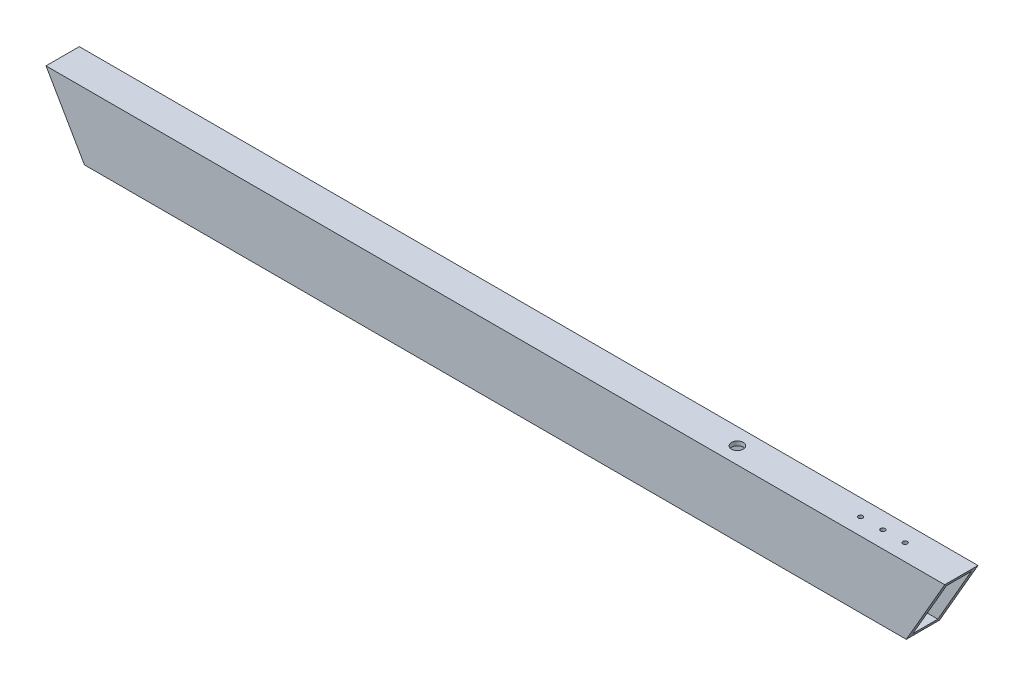
ISO-10303-21;
HEADER;
FILE_DESCRIPTION(('STEP AP214'),'2;1');
FILE_NAME('part.step','',(''),(''),'','','');
FILE_SCHEMA(('AUTOMOTIVE_DESIGN { 1 0 10303 214 1 1 1 1 }'));
ENDSEC;
DATA;
#1=APPLICATION_CONTEXT('core data for automotive mechanical design processes');
#2=APPLICATION_PROTOCOL_DEFINITION('international standard','automotive_design',2000,#1);
#3=PRODUCT_CONTEXT('',#1,'mechanical');
#4=PRODUCT('Part','Part','',(#3));
#5=PRODUCT_RELATED_PRODUCT_CATEGORY('part','',(#4));
#6=PRODUCT_DEFINITION_FORMATION('','',#4);
#7=PRODUCT_DEFINITION_CONTEXT('part definition',#1,'design');
#8=PRODUCT_DEFINITION('design','',#6,#7);
#9=PRODUCT_DEFINITION_SHAPE('','',#8);
#10=(LENGTH_UNIT() NAMED_UNIT(*) SI_UNIT(.MILLI.,.METRE.));
#11=(NAMED_UNIT(*) PLANE_ANGLE_UNIT() SI_UNIT($,.RADIAN.));
#12=(NAMED_UNIT(*) SI_UNIT($,.STERADIAN.) SOLID_ANGLE_UNIT());
#13=UNCERTAINTY_MEASURE_WITH_UNIT(LENGTH_MEASURE(1.E-05),#10,'distance_accuracy_value','');
#14=(GEOMETRIC_REPRESENTATION_CONTEXT(3) GLOBAL_UNCERTAINTY_ASSIGNED_CONTEXT((#13)) GLOBAL_UNIT_ASSIGNED_CONTEXT((#10,
#11,#12)) REPRESENTATION_CONTEXT('',''));
#15=CARTESIAN_POINT('',(0.,0.,0.));
#16=DIRECTION('',(0.,0.,1.));
#17=DIRECTION('',(1.,0.,0.));
#18=AXIS2_PLACEMENT_3D('',#15,#16,#17);
#19=CARTESIAN_POINT('',(342.9,-22.225,9.525));
#20=DIRECTION('',(0.,1.,0.));
#21=DIRECTION('',(0.,0.,1.));
#22=AXIS2_PLACEMENT_3D('',#19,#20,#21);
#23=PLANE('',#22);
#24=DIRECTION('',(0.,0.,-1.));
#25=VECTOR('',#24,1.);
#26=CARTESIAN_POINT('',(-315.403693429844,-22.225,9.525));
#27=LINE('',#26,#25);
#28=CARTESIAN_POINT('',(-315.403693429844,-22.225,9.525));
#29=VERTEX_POINT('',#28);
#30=CARTESIAN_POINT('',(-315.403693429844,-22.225,-9.525));
#31=VERTEX_POINT('',#30);
#32=EDGE_CURVE('E11',#29,#31,#27,.T.);
#33=ORIENTED_EDGE('',*,*,#32,.F.);
#34=DIRECTION('',(-1.,0.,0.));
#35=VECTOR('',#34,1.);
#36=CARTESIAN_POINT('',(342.9,-22.225,9.525));
#37=LINE('',#36,#35);
#38=CARTESIAN_POINT('',(315.403693429844,-22.225,9.525));
#39=VERTEX_POINT('',#38);
#40=EDGE_CURVE('E135',#39,#29,#37,.T.);
#41=ORIENTED_EDGE('',*,*,#40,.F.);
#42=DIRECTION('',(0.,0.,-1.));
#43=VECTOR('',#42,1.);
#44=CARTESIAN_POINT('',(315.403693429844,-22.225,9.525));
#45=LINE('',#44,#43);
#46=CARTESIAN_POINT('',(315.403693429844,-22.225,-9.525));
#47=VERTEX_POINT('',#46);
#48=EDGE_CURVE('E44',#39,#47,#45,.T.);
#49=ORIENTED_EDGE('',*,*,#48,.T.);
#50=DIRECTION('',(-1.,0.,0.));
#51=VECTOR('',#50,1.);
#52=CARTESIAN_POINT('',(342.9,-22.225,-9.525));
#53=LINE('',#52,#51);
#54=EDGE_CURVE('E133',#47,#31,#53,.T.);
#55=ORIENTED_EDGE('',*,*,#54,.T.);
#56=EDGE_LOOP('',(#33,#41,#49,#55));
#57=FACE_BOUND('',#56,.T.);
#58=ADVANCED_FACE('F36',(#57),#23,.T.);
#59=CARTESIAN_POINT('',(342.9,-22.225,9.525));
#60=DIRECTION('',(0.,0.,-1.));
#61=DIRECTION('',(-1.,0.,0.));
#62=AXIS2_PLACEMENT_3D('',#59,#60,#61);
#63=PLANE('',#62);
#64=DIRECTION('',(0.500000000000004,-0.866025403784436,0.));
#65=VECTOR('',#64,1.);
#66=CARTESIAN_POINT('',(-150.82777007238,-307.278860957686,9.525));
#67=LINE('',#66,#65);
#68=CARTESIAN_POINT('',(-341.066912895323,22.2250000000001,9.525));
#69=VERTEX_POINT('',#68);
#70=EDGE_CURVE('E175',#69,#29,#67,.T.);
#71=ORIENTED_EDGE('',*,*,#70,.F.);
#72=DIRECTION('',(-1.,0.,0.));
#73=VECTOR('',#72,1.);
#74=CARTESIAN_POINT('',(342.9,22.225,9.525));
#75=LINE('',#74,#73);
#76=CARTESIAN_POINT('',(341.066912895323,22.225,9.525));
#77=VERTEX_POINT('',#76);
#78=EDGE_CURVE('E147',#77,#69,#75,.T.);
#79=ORIENTED_EDGE('',*,*,#78,.F.);
#80=DIRECTION('',(-0.500000000000004,-0.866025403784436,0.));
#81=VECTOR('',#80,1.);
#82=CARTESIAN_POINT('',(322.277770072383,-10.3187499999998,9.525));
#83=LINE('',#82,#81);
#84=EDGE_CURVE('E162',#77,#39,#83,.T.);
#85=ORIENTED_EDGE('',*,*,#84,.T.);
#86=ORIENTED_EDGE('',*,*,#40,.T.);
#87=EDGE_LOOP('',(#71,#79,#85,#86));
#88=FACE_BOUND('',#87,.T.);
#89=ADVANCED_FACE('F185',(#88),#63,.T.);
#90=CARTESIAN_POINT('',(342.9,22.225,9.525));
#91=DIRECTION('',(0.,-1.,0.));
#92=DIRECTION('',(0.,0.,-1.));
#93=AXIS2_PLACEMENT_3D('',#90,#91,#92);
#94=PLANE('',#93);
#95=CARTESIAN_POINT('',(171.991366477797,22.225,6.10622663543836E-13));
#96=DIRECTION('',(0.,-1.,0.));
#97=DIRECTION('',(0.,0.,-1.));
#98=AXIS2_PLACEMENT_3D('',#95,#96,#97);
#99=CIRCLE('',#98,4.49999999999999);
#100=CARTESIAN_POINT('',(171.991366477797,22.225,-4.49999999999938));
#101=VERTEX_POINT('',#100);
#102=EDGE_CURVE('E291',#101,#101,#99,.T.);
#103=ORIENTED_EDGE('',*,*,#102,.F.);
#104=EDGE_LOOP('',(#103));
#105=FACE_BOUND('',#104,.T.);
#106=CARTESIAN_POINT('',(299.991366477797,22.225,1.86829718362702E-12));
#107=DIRECTION('',(0.,-1.,0.));
#108=DIRECTION('',(0.,0.,-1.));
#109=AXIS2_PLACEMENT_3D('',#106,#107,#108);
#110=CIRCLE('',#109,1.69999999999998);
#111=CARTESIAN_POINT('',(299.991366477797,22.225,-1.69999999999811));
#112=VERTEX_POINT('',#111);
#113=EDGE_CURVE('E296',#112,#112,#110,.T.);
#114=ORIENTED_EDGE('',*,*,#113,.F.);
#115=EDGE_LOOP('',(#114));
#116=FACE_BOUND('',#115,.T.);
#117=CARTESIAN_POINT('',(282.991366477797,22.225,5.68989300120393E-13));
#118=DIRECTION('',(0.,-1.,0.));
#119=DIRECTION('',(0.,0.,-1.));
#120=AXIS2_PLACEMENT_3D('',#117,#118,#119);
#121=CIRCLE('',#120,1.69999999999998);
#122=CARTESIAN_POINT('',(282.991366477797,22.225,-1.69999999999941));
#123=VERTEX_POINT('',#122);
#124=EDGE_CURVE('E237',#123,#123,#121,.T.);
#125=ORIENTED_EDGE('',*,*,#124,.F.);
#126=EDGE_LOOP('',(#125));
#127=FACE_BOUND('',#126,.T.);
#128=CARTESIAN_POINT('',(265.991366477797,22.225,5.68989300120393E-13));
#129=DIRECTION('',(0.,-1.,0.));
#130=DIRECTION('',(0.,0.,-1.));
#131=AXIS2_PLACEMENT_3D('',#128,#129,#130);
#132=CIRCLE('',#131,1.69999999999998);
#133=CARTESIAN_POINT('',(265.991366477797,22.225,-1.69999999999941));
#134=VERTEX_POINT('',#133);
#135=EDGE_CURVE('E236',#134,#134,#132,.T.);
#136=ORIENTED_EDGE('',*,*,#135,.F.);
#137=EDGE_LOOP('',(#136));
#138=FACE_BOUND('',#137,.T.);
#139=DIRECTION('',(0.,0.,1.));
#140=VECTOR('',#139,1.);
#141=CARTESIAN_POINT('',(-341.066912895323,22.225,9.525));
#142=LINE('',#141,#140);
#143=CARTESIAN_POINT('',(-341.066912895323,22.225,-9.525));
#144=VERTEX_POINT('',#143);
#145=EDGE_CURVE('E177',#144,#69,#142,.T.);
#146=ORIENTED_EDGE('',*,*,#145,.F.);
#147=DIRECTION('',(-1.,0.,0.));
#148=VECTOR('',#147,1.);
#149=CARTESIAN_POINT('',(342.9,22.225,-9.525));
#150=LINE('',#149,#148);
#151=CARTESIAN_POINT('',(341.066912895323,22.225,-9.525));
#152=VERTEX_POINT('',#151);
#153=EDGE_CURVE('E118',#152,#144,#150,.T.);
#154=ORIENTED_EDGE('',*,*,#153,.F.);
#155=DIRECTION('',(0.,0.,1.));
#156=VECTOR('',#155,1.);
#157=CARTESIAN_POINT('',(341.066912895323,22.225,9.525));
#158=LINE('',#157,#156);
#159=EDGE_CURVE('E164',#152,#77,#158,.T.);
#160=ORIENTED_EDGE('',*,*,#159,.T.);
#161=ORIENTED_EDGE('',*,*,#78,.T.);
#162=EDGE_LOOP('',(#146,#154,#160,#161));
#163=FACE_BOUND('',#162,.T.);
#164=ADVANCED_FACE('F182',(#105,#116,#127,#138,#163),#94,.T.);
#165=CARTESIAN_POINT('',(342.9,-22.225,-9.525));
#166=DIRECTION('',(0.,0.,1.));
#167=DIRECTION('',(1.,0.,0.));
#168=AXIS2_PLACEMENT_3D('',#165,#166,#167);
#169=PLANE('',#168);
#170=CARTESIAN_POINT('',(234.95,0.,-9.525));
#171=DIRECTION('',(0.,0.,1.));
#172=DIRECTION('',(1.,0.,0.));
#173=AXIS2_PLACEMENT_3D('',#170,#171,#172);
#174=CIRCLE('',#173,11.1125);
#175=CARTESIAN_POINT('',(246.0625,0.,-9.525));
#176=VERTEX_POINT('',#175);
#177=EDGE_CURVE('E246',#176,#176,#174,.F.);
#178=ORIENTED_EDGE('',*,*,#177,.T.);
#179=EDGE_LOOP('',(#178));
#180=FACE_BOUND('',#179,.T.);
#181=CARTESIAN_POINT('',(190.5,0.,-9.525));
#182=DIRECTION('',(0.,0.,1.));
#183=DIRECTION('',(1.,0.,0.));
#184=AXIS2_PLACEMENT_3D('',#181,#182,#183);
#185=CIRCLE('',#184,11.1125);
#186=CARTESIAN_POINT('',(201.6125,0.,-9.525));
#187=VERTEX_POINT('',#186);
#188=EDGE_CURVE('E249',#187,#187,#185,.F.);
#189=ORIENTED_EDGE('',*,*,#188,.T.);
#190=EDGE_LOOP('',(#189));
#191=FACE_BOUND('',#190,.T.);
#192=DIRECTION('',(-0.500000000000004,0.866025403784436,0.));
#193=VECTOR('',#192,1.);
#194=CARTESIAN_POINT('',(-150.82777007238,-307.278860957686,-9.525));
#195=LINE('',#194,#193);
#196=EDGE_CURVE('E145',#31,#144,#195,.T.);
#197=ORIENTED_EDGE('',*,*,#196,.F.);
#198=ORIENTED_EDGE('',*,*,#54,.F.);
#199=DIRECTION('',(0.500000000000004,0.866025403784436,0.));
#200=VECTOR('',#199,1.);
#201=CARTESIAN_POINT('',(322.277770072383,-10.3187499999998,-9.525));
#202=LINE('',#201,#200);
#203=EDGE_CURVE('E143',#47,#152,#202,.T.);
#204=ORIENTED_EDGE('',*,*,#203,.T.);
#205=ORIENTED_EDGE('',*,*,#153,.T.);
#206=EDGE_LOOP('',(#197,#198,#204,#205));
#207=FACE_BOUND('',#206,.T.);
#208=ADVANCED_FACE('F141',(#180,#191,#207),#169,.T.);
#209=CARTESIAN_POINT('',(246.176477371936,-142.130055478843,12.7));
#210=DIRECTION('',(0.866025403784436,-0.500000000000004,0.));
#211=DIRECTION('',(0.500000000000004,0.866025403784436,0.));
#212=AXIS2_PLACEMENT_3D('',#209,#210,#211);
#213=PLANE('',#212);
#214=ORIENTED_EDGE('',*,*,#48,.F.);
#215=ORIENTED_EDGE('',*,*,#84,.F.);
#216=ORIENTED_EDGE('',*,*,#159,.F.);
#217=ORIENTED_EDGE('',*,*,#203,.F.);
#218=EDGE_LOOP('',(#214,#215,#216,#217));
#219=FACE_BOUND('',#218,.T.);
#220=DIRECTION('',(0.500000000000004,0.866025403784436,0.));
#221=VECTOR('',#220,1.);
#222=CARTESIAN_POINT('',(320.902954743875,-12.6999999999998,-12.7));
#223=LINE('',#222,#221);
#224=CARTESIAN_POINT('',(313.570606325167,-25.4,-12.7));
#225=VERTEX_POINT('',#224);
#226=CARTESIAN_POINT('',(342.9,25.4,-12.7));
#227=VERTEX_POINT('',#226);
#228=EDGE_CURVE('E159',#225,#227,#223,.T.);
#229=ORIENTED_EDGE('',*,*,#228,.T.);
#230=DIRECTION('',(0.,0.,1.));
#231=VECTOR('',#230,1.);
#232=CARTESIAN_POINT('',(342.9,25.4,12.7));
#233=LINE('',#232,#231);
#234=CARTESIAN_POINT('',(342.9,25.4,12.7));
#235=VERTEX_POINT('',#234);
#236=EDGE_CURVE('E117',#227,#235,#233,.T.);
#237=ORIENTED_EDGE('',*,*,#236,.T.);
#238=DIRECTION('',(-0.500000000000005,-0.866025403784436,0.));
#239=VECTOR('',#238,1.);
#240=CARTESIAN_POINT('',(246.176477371936,-142.130055478843,12.7));
#241=LINE('',#240,#239);
#242=CARTESIAN_POINT('',(313.570606325167,-25.4,12.7));
#243=VERTEX_POINT('',#242);
#244=EDGE_CURVE('E51',#235,#243,#241,.T.);
#245=ORIENTED_EDGE('',*,*,#244,.T.);
#246=DIRECTION('',(0.,0.,-1.));
#247=VECTOR('',#246,1.);
#248=CARTESIAN_POINT('',(313.570606325167,-25.4,12.7));
#249=LINE('',#248,#247);
#250=EDGE_CURVE('E107',#243,#225,#249,.T.);
#251=ORIENTED_EDGE('',*,*,#250,.T.);
#252=EDGE_LOOP('',(#229,#237,#245,#251));
#253=FACE_BOUND('',#252,.T.);
#254=ADVANCED_FACE('F186',(#219,#253),#213,.T.);
#255=CARTESIAN_POINT('',(-246.176477371936,-142.130055478843,12.7));
#256=DIRECTION('',(0.866025403784436,0.500000000000004,0.));
#257=DIRECTION('',(-0.500000000000004,0.866025403784436,0.));
#258=AXIS2_PLACEMENT_3D('',#255,#256,#257);
#259=PLANE('',#258);
#260=ORIENTED_EDGE('',*,*,#196,.T.);
#261=ORIENTED_EDGE('',*,*,#145,.T.);
#262=ORIENTED_EDGE('',*,*,#70,.T.);
#263=ORIENTED_EDGE('',*,*,#32,.T.);
#264=EDGE_LOOP('',(#260,#261,#262,#263));
#265=FACE_BOUND('',#264,.T.);
#266=DIRECTION('',(0.,0.,-1.));
#267=VECTOR('',#266,1.);
#268=CARTESIAN_POINT('',(-313.570606325167,-25.4,12.7));
#269=LINE('',#268,#267);
#270=CARTESIAN_POINT('',(-313.570606325167,-25.4,12.7));
#271=VERTEX_POINT('',#270);
#272=CARTESIAN_POINT('',(-313.570606325167,-25.4,-12.7));
#273=VERTEX_POINT('',#272);
#274=EDGE_CURVE('E102',#271,#273,#269,.T.);
#275=ORIENTED_EDGE('',*,*,#274,.F.);
#276=DIRECTION('',(0.500000000000005,-0.866025403784436,0.));
#277=VECTOR('',#276,1.);
#278=CARTESIAN_POINT('',(-246.176477371936,-142.130055478843,12.7));
#279=LINE('',#278,#277);
#280=CARTESIAN_POINT('',(-342.9,25.4,12.7));
#281=VERTEX_POINT('',#280);
#282=EDGE_CURVE('E98',#281,#271,#279,.T.);
#283=ORIENTED_EDGE('',*,*,#282,.F.);
#284=DIRECTION('',(0.,0.,1.));
#285=VECTOR('',#284,1.);
#286=CARTESIAN_POINT('',(-342.9,25.4,12.7));
#287=LINE('',#286,#285);
#288=CARTESIAN_POINT('',(-342.9,25.4,-12.7));
#289=VERTEX_POINT('',#288);
#290=EDGE_CURVE('E101',#289,#281,#287,.T.);
#291=ORIENTED_EDGE('',*,*,#290,.F.);
#292=DIRECTION('',(-0.500000000000004,0.866025403784436,0.));
#293=VECTOR('',#292,1.);
#294=CARTESIAN_POINT('',(-149.452954743872,-309.660110957686,-12.7));
#295=LINE('',#294,#293);
#296=EDGE_CURVE('E59',#273,#289,#295,.T.);
#297=ORIENTED_EDGE('',*,*,#296,.F.);
#298=EDGE_LOOP('',(#275,#283,#291,#297));
#299=FACE_BOUND('',#298,.T.);
#300=ADVANCED_FACE('F100',(#265,#299),#259,.F.);
#301=CARTESIAN_POINT('',(342.9,-25.4,-12.7));
#302=DIRECTION('',(0.,0.,1.));
#303=DIRECTION('',(1.,0.,0.));
#304=AXIS2_PLACEMENT_3D('',#301,#302,#303);
#305=PLANE('',#304);
#306=CARTESIAN_POINT('',(234.95,0.,-12.7));
#307=DIRECTION('',(0.,0.,-1.));
#308=DIRECTION('',(-1.,0.,0.));
#309=AXIS2_PLACEMENT_3D('',#306,#307,#308);
#310=CIRCLE('',#309,11.1125);
#311=CARTESIAN_POINT('',(223.8375,0.,-12.7));
#312=VERTEX_POINT('',#311);
#313=EDGE_CURVE('E169',#312,#312,#310,.T.);
#314=ORIENTED_EDGE('',*,*,#313,.F.);
#315=EDGE_LOOP('',(#314));
#316=FACE_BOUND('',#315,.T.);
#317=CARTESIAN_POINT('',(190.5,0.,-12.7));
#318=DIRECTION('',(0.,0.,-1.));
#319=DIRECTION('',(-1.,0.,0.));
#320=AXIS2_PLACEMENT_3D('',#317,#318,#319);
#321=CIRCLE('',#320,11.1125);
#322=CARTESIAN_POINT('',(179.3875,0.,-12.7));
#323=VERTEX_POINT('',#322);
#324=EDGE_CURVE('E240',#323,#323,#321,.T.);
#325=ORIENTED_EDGE('',*,*,#324,.F.);
#326=EDGE_LOOP('',(#325));
#327=FACE_BOUND('',#326,.T.);
#328=DIRECTION('',(-1.,0.,0.));
#329=VECTOR('',#328,1.);
#330=CARTESIAN_POINT('',(342.9,-25.4,-12.7));
#331=LINE('',#330,#329);
#332=EDGE_CURVE('E124',#225,#273,#331,.T.);
#333=ORIENTED_EDGE('',*,*,#332,.T.);
#334=ORIENTED_EDGE('',*,*,#296,.T.);
#335=DIRECTION('',(-1.,0.,0.));
#336=VECTOR('',#335,1.);
#337=CARTESIAN_POINT('',(342.9,25.4,-12.7));
#338=LINE('',#337,#336);
#339=EDGE_CURVE('E116',#227,#289,#338,.T.);
#340=ORIENTED_EDGE('',*,*,#339,.F.);
#341=ORIENTED_EDGE('',*,*,#228,.F.);
#342=EDGE_LOOP('',(#333,#334,#340,#341));
#343=FACE_BOUND('',#342,.T.);
#344=ADVANCED_FACE('F38',(#316,#327,#343),#305,.F.);
#345=CARTESIAN_POINT('',(342.9,-25.4,12.7));
#346=DIRECTION('',(0.,0.,-1.));
#347=DIRECTION('',(-1.,0.,0.));
#348=AXIS2_PLACEMENT_3D('',#345,#346,#347);
#349=PLANE('',#348);
#350=DIRECTION('',(-1.,0.,0.));
#351=VECTOR('',#350,1.);
#352=CARTESIAN_POINT('',(342.9,25.4,12.7));
#353=LINE('',#352,#351);
#354=EDGE_CURVE('E114',#235,#281,#353,.T.);
#355=ORIENTED_EDGE('',*,*,#354,.T.);
#356=ORIENTED_EDGE('',*,*,#282,.T.);
#357=DIRECTION('',(-1.,0.,0.));
#358=VECTOR('',#357,1.);
#359=CARTESIAN_POINT('',(342.9,-25.4,12.7));
#360=LINE('',#359,#358);
#361=EDGE_CURVE('E121',#243,#271,#360,.T.);
#362=ORIENTED_EDGE('',*,*,#361,.F.);
#363=ORIENTED_EDGE('',*,*,#244,.F.);
#364=EDGE_LOOP('',(#355,#356,#362,#363));
#365=FACE_BOUND('',#364,.T.);
#366=ADVANCED_FACE('F120',(#365),#349,.F.);
#367=CARTESIAN_POINT('',(342.9,-25.4,12.7));
#368=DIRECTION('',(0.,1.,0.));
#369=DIRECTION('',(0.,0.,1.));
#370=AXIS2_PLACEMENT_3D('',#367,#368,#369);
#371=PLANE('',#370);
#372=ORIENTED_EDGE('',*,*,#361,.T.);
#373=ORIENTED_EDGE('',*,*,#274,.T.);
#374=ORIENTED_EDGE('',*,*,#332,.F.);
#375=ORIENTED_EDGE('',*,*,#250,.F.);
#376=EDGE_LOOP('',(#372,#373,#374,#375));
#377=FACE_BOUND('',#376,.T.);
#378=ADVANCED_FACE('F161',(#377),#371,.F.);
#379=CARTESIAN_POINT('',(342.9,25.4,12.7));
#380=DIRECTION('',(0.,-1.,0.));
#381=DIRECTION('',(0.,0.,-1.));
#382=AXIS2_PLACEMENT_3D('',#379,#380,#381);
#383=PLANE('',#382);
#384=CARTESIAN_POINT('',(171.991366477797,25.4,6.10622663543836E-13));
#385=DIRECTION('',(0.,1.,0.));
#386=DIRECTION('',(0.,0.,1.));
#387=AXIS2_PLACEMENT_3D('',#384,#385,#386);
#388=CIRCLE('',#387,4.49999999999999);
#389=CARTESIAN_POINT('',(171.991366477797,25.4,4.5000000000006));
#390=VERTEX_POINT('',#389);
#391=EDGE_CURVE('E223',#390,#390,#388,.T.);
#392=ORIENTED_EDGE('',*,*,#391,.F.);
#393=EDGE_LOOP('',(#392));
#394=FACE_BOUND('',#393,.T.);
#395=CARTESIAN_POINT('',(299.991366477797,25.4,1.86829718362702E-12));
#396=DIRECTION('',(0.,1.,0.));
#397=DIRECTION('',(0.,0.,1.));
#398=AXIS2_PLACEMENT_3D('',#395,#396,#397);
#399=CIRCLE('',#398,1.69999999999998);
#400=CARTESIAN_POINT('',(299.991366477797,25.4,1.70000000000185));
#401=VERTEX_POINT('',#400);
#402=EDGE_CURVE('E227',#401,#401,#399,.T.);
#403=ORIENTED_EDGE('',*,*,#402,.F.);
#404=EDGE_LOOP('',(#403));
#405=FACE_BOUND('',#404,.T.);
#406=CARTESIAN_POINT('',(282.991366477797,25.4,5.68989300120393E-13));
#407=DIRECTION('',(0.,1.,0.));
#408=DIRECTION('',(0.,0.,1.));
#409=AXIS2_PLACEMENT_3D('',#406,#407,#408);
#410=CIRCLE('',#409,1.69999999999998);
#411=CARTESIAN_POINT('',(282.991366477797,25.4,1.70000000000055));
#412=VERTEX_POINT('',#411);
#413=EDGE_CURVE('E231',#412,#412,#410,.T.);
#414=ORIENTED_EDGE('',*,*,#413,.F.);
#415=EDGE_LOOP('',(#414));
#416=FACE_BOUND('',#415,.T.);
#417=CARTESIAN_POINT('',(265.991366477797,25.4,5.68989300120393E-13));
#418=DIRECTION('',(0.,1.,0.));
#419=DIRECTION('',(0.,0.,1.));
#420=AXIS2_PLACEMENT_3D('',#417,#418,#419);
#421=CIRCLE('',#420,1.69999999999998);
#422=CARTESIAN_POINT('',(265.991366477797,25.4,1.70000000000055));
#423=VERTEX_POINT('',#422);
#424=EDGE_CURVE('E234',#423,#423,#421,.T.);
#425=ORIENTED_EDGE('',*,*,#424,.F.);
#426=EDGE_LOOP('',(#425));
#427=FACE_BOUND('',#426,.T.);
#428=ORIENTED_EDGE('',*,*,#290,.T.);
#429=ORIENTED_EDGE('',*,*,#354,.F.);
#430=ORIENTED_EDGE('',*,*,#236,.F.);
#431=ORIENTED_EDGE('',*,*,#339,.T.);
#432=EDGE_LOOP('',(#428,#429,#430,#431));
#433=FACE_BOUND('',#432,.T.);
#434=ADVANCED_FACE('F112',(#394,#405,#416,#427,#433),#383,.F.);
#435=CARTESIAN_POINT('',(190.5,0.,12.701));
#436=DIRECTION('',(0.,0.,-1.));
#437=DIRECTION('',(-1.,0.,0.));
#438=AXIS2_PLACEMENT_3D('',#435,#436,#437);
#439=CYLINDRICAL_SURFACE('',#438,11.1125);
#440=ORIENTED_EDGE('',*,*,#188,.F.);
#441=EDGE_LOOP('',(#440));
#442=FACE_BOUND('',#441,.T.);
#443=ORIENTED_EDGE('',*,*,#324,.T.);
#444=EDGE_LOOP('',(#443));
#445=FACE_BOUND('',#444,.T.);
#446=ADVANCED_FACE('F211',(#442,#445),#439,.F.);
#447=CARTESIAN_POINT('',(234.95,0.,12.701));
#448=DIRECTION('',(0.,0.,-1.));
#449=DIRECTION('',(-1.,0.,0.));
#450=AXIS2_PLACEMENT_3D('',#447,#448,#449);
#451=CYLINDRICAL_SURFACE('',#450,11.1125);
#452=ORIENTED_EDGE('',*,*,#177,.F.);
#453=EDGE_LOOP('',(#452));
#454=FACE_BOUND('',#453,.T.);
#455=ORIENTED_EDGE('',*,*,#313,.T.);
#456=EDGE_LOOP('',(#455));
#457=FACE_BOUND('',#456,.T.);
#458=ADVANCED_FACE('F217',(#454,#457),#451,.F.);
#459=CARTESIAN_POINT('',(265.991366477797,25.4,5.68989300120393E-13));
#460=DIRECTION('',(0.,1.,0.));
#461=DIRECTION('',(0.,0.,1.));
#462=AXIS2_PLACEMENT_3D('',#459,#460,#461);
#463=CYLINDRICAL_SURFACE('',#462,1.69999999999998);
#464=ORIENTED_EDGE('',*,*,#424,.T.);
#465=EDGE_LOOP('',(#464));
#466=FACE_BOUND('',#465,.T.);
#467=ORIENTED_EDGE('',*,*,#135,.T.);
#468=EDGE_LOOP('',(#467));
#469=FACE_BOUND('',#468,.T.);
#470=ADVANCED_FACE('F267',(#466,#469),#463,.F.);
#471=CARTESIAN_POINT('',(282.991366477797,25.4,5.68989300120393E-13));
#472=DIRECTION('',(0.,1.,0.));
#473=DIRECTION('',(0.,0.,1.));
#474=AXIS2_PLACEMENT_3D('',#471,#472,#473);
#475=CYLINDRICAL_SURFACE('',#474,1.69999999999998);
#476=ORIENTED_EDGE('',*,*,#413,.T.);
#477=EDGE_LOOP('',(#476));
#478=FACE_BOUND('',#477,.T.);
#479=ORIENTED_EDGE('',*,*,#124,.T.);
#480=EDGE_LOOP('',(#479));
#481=FACE_BOUND('',#480,.T.);
#482=ADVANCED_FACE('F273',(#478,#481),#475,.F.);
#483=CARTESIAN_POINT('',(299.991366477797,25.4,1.86829718362702E-12));
#484=DIRECTION('',(0.,1.,0.));
#485=DIRECTION('',(0.,0.,1.));
#486=AXIS2_PLACEMENT_3D('',#483,#484,#485);
#487=CYLINDRICAL_SURFACE('',#486,1.69999999999998);
#488=ORIENTED_EDGE('',*,*,#402,.T.);
#489=EDGE_LOOP('',(#488));
#490=FACE_BOUND('',#489,.T.);
#491=ORIENTED_EDGE('',*,*,#113,.T.);
#492=EDGE_LOOP('',(#491));
#493=FACE_BOUND('',#492,.T.);
#494=ADVANCED_FACE('F279',(#490,#493),#487,.F.);
#495=CARTESIAN_POINT('',(171.991366477797,12.7,6.10622663543836E-13));
#496=DIRECTION('',(0.,1.,0.));
#497=DIRECTION('',(0.,0.,1.));
#498=AXIS2_PLACEMENT_3D('',#495,#496,#497);
#499=CYLINDRICAL_SURFACE('',#498,4.49999999999999);
#500=ORIENTED_EDGE('',*,*,#102,.T.);
#501=EDGE_LOOP('',(#500));
#502=FACE_BOUND('',#501,.T.);
#503=ORIENTED_EDGE('',*,*,#391,.T.);
#504=EDGE_LOOP('',(#503));
#505=FACE_BOUND('',#504,.T.);
#506=ADVANCED_FACE('F283',(#502,#505),#499,.F.);
#507=CLOSED_SHELL('',(#58,#89,#164,#208,#254,#300,#344,#366,#378,#434,#446,#458,#470,#482,#494,#506));
#508=MANIFOLD_SOLID_BREP('B2',#507);
#509=ADVANCED_BREP_SHAPE_REPRESENTATION('',(#18,#508),#14);
#510=SHAPE_DEFINITION_REPRESENTATION(#9,#509);
ENDSEC;
END-ISO-10303-21;
